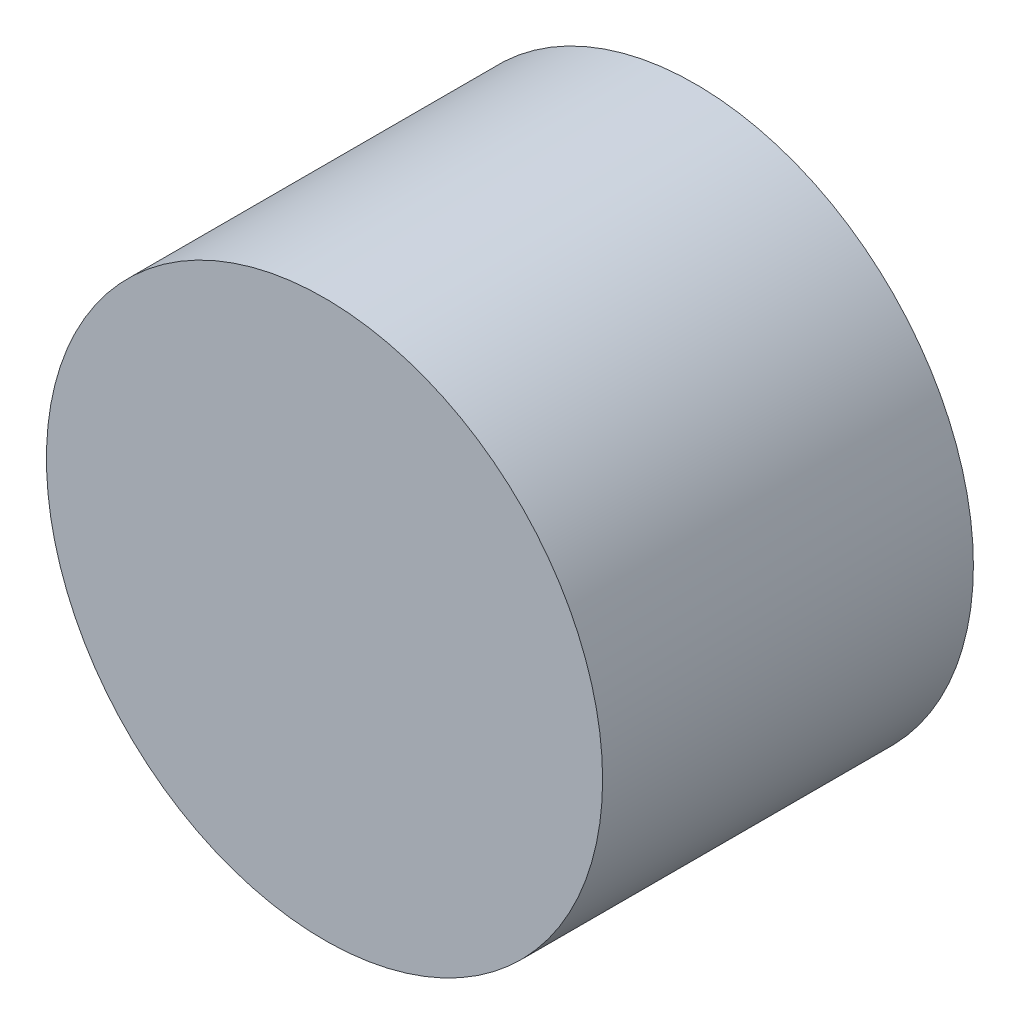
ISO-10303-21;
HEADER;
FILE_DESCRIPTION(('STEP AP214'),'2;1');
FILE_NAME('part.step','',(''),(''),'','','');
FILE_SCHEMA(('AUTOMOTIVE_DESIGN { 1 0 10303 214 1 1 1 1 }'));
ENDSEC;
DATA;
#1=APPLICATION_CONTEXT('core data for automotive mechanical design processes');
#2=APPLICATION_PROTOCOL_DEFINITION('international standard','automotive_design',2000,#1);
#3=PRODUCT_CONTEXT('',#1,'mechanical');
#4=PRODUCT('Part','Part','',(#3));
#5=PRODUCT_RELATED_PRODUCT_CATEGORY('part','',(#4));
#6=PRODUCT_DEFINITION_FORMATION('','',#4);
#7=PRODUCT_DEFINITION_CONTEXT('part definition',#1,'design');
#8=PRODUCT_DEFINITION('design','',#6,#7);
#9=PRODUCT_DEFINITION_SHAPE('','',#8);
#10=(LENGTH_UNIT() NAMED_UNIT(*) SI_UNIT(.MILLI.,.METRE.));
#11=(NAMED_UNIT(*) PLANE_ANGLE_UNIT() SI_UNIT($,.RADIAN.));
#12=(NAMED_UNIT(*) SI_UNIT($,.STERADIAN.) SOLID_ANGLE_UNIT());
#13=UNCERTAINTY_MEASURE_WITH_UNIT(LENGTH_MEASURE(1.E-05),#10,'distance_accuracy_value','');
#14=(GEOMETRIC_REPRESENTATION_CONTEXT(3) GLOBAL_UNCERTAINTY_ASSIGNED_CONTEXT((#13)) GLOBAL_UNIT_ASSIGNED_CONTEXT((#10,
#11,#12)) REPRESENTATION_CONTEXT('',''));
#15=CARTESIAN_POINT('',(0.,0.,0.));
#16=DIRECTION('',(0.,0.,1.));
#17=DIRECTION('',(1.,0.,0.));
#18=AXIS2_PLACEMENT_3D('',#15,#16,#17);
#19=CARTESIAN_POINT('',(0.,0.,2.));
#20=DIRECTION('',(0.,0.,-1.));
#21=DIRECTION('',(-1.,0.,0.));
#22=AXIS2_PLACEMENT_3D('',#19,#20,#21);
#23=CYLINDRICAL_SURFACE('',#22,1.5);
#24=CARTESIAN_POINT('',(0.,0.,2.));
#25=DIRECTION('',(0.,0.,1.));
#26=DIRECTION('',(1.,0.,0.));
#27=AXIS2_PLACEMENT_3D('',#24,#25,#26);
#28=CIRCLE('',#27,1.5);
#29=CARTESIAN_POINT('',(1.5,0.,2.));
#30=VERTEX_POINT('',#29);
#31=EDGE_CURVE('E10',#30,#30,#28,.T.);
#32=ORIENTED_EDGE('',*,*,#31,.F.);
#33=EDGE_LOOP('',(#32));
#34=FACE_BOUND('',#33,.T.);
#35=CARTESIAN_POINT('',(0.,0.,0.));
#36=DIRECTION('',(0.,0.,1.));
#37=DIRECTION('',(1.,0.,0.));
#38=AXIS2_PLACEMENT_3D('',#35,#36,#37);
#39=CIRCLE('',#38,1.5);
#40=CARTESIAN_POINT('',(1.5,0.,0.));
#41=VERTEX_POINT('',#40);
#42=EDGE_CURVE('E37',#41,#41,#39,.T.);
#43=ORIENTED_EDGE('',*,*,#42,.T.);
#44=EDGE_LOOP('',(#43));
#45=FACE_BOUND('',#44,.T.);
#46=ADVANCED_FACE('F34',(#34,#45),#23,.T.);
#47=CARTESIAN_POINT('',(0.,0.,2.));
#48=DIRECTION('',(0.,0.,1.));
#49=DIRECTION('',(1.,0.,0.));
#50=AXIS2_PLACEMENT_3D('',#47,#48,#49);
#51=PLANE('',#50);
#52=ORIENTED_EDGE('',*,*,#31,.T.);
#53=EDGE_LOOP('',(#52));
#54=FACE_BOUND('',#53,.T.);
#55=ADVANCED_FACE('F49',(#54),#51,.T.);
#56=CARTESIAN_POINT('',(0.,0.,0.));
#57=DIRECTION('',(0.,0.,1.));
#58=DIRECTION('',(1.,0.,0.));
#59=AXIS2_PLACEMENT_3D('',#56,#57,#58);
#60=PLANE('',#59);
#61=ORIENTED_EDGE('',*,*,#42,.F.);
#62=EDGE_LOOP('',(#61));
#63=FACE_BOUND('',#62,.T.);
#64=ADVANCED_FACE('F47',(#63),#60,.F.);
#65=CLOSED_SHELL('',(#46,#55,#64));
#66=MANIFOLD_SOLID_BREP('B2',#65);
#67=ADVANCED_BREP_SHAPE_REPRESENTATION('',(#18,#66),#14);
#68=SHAPE_DEFINITION_REPRESENTATION(#9,#67);
ENDSEC;
END-ISO-10303-21;
